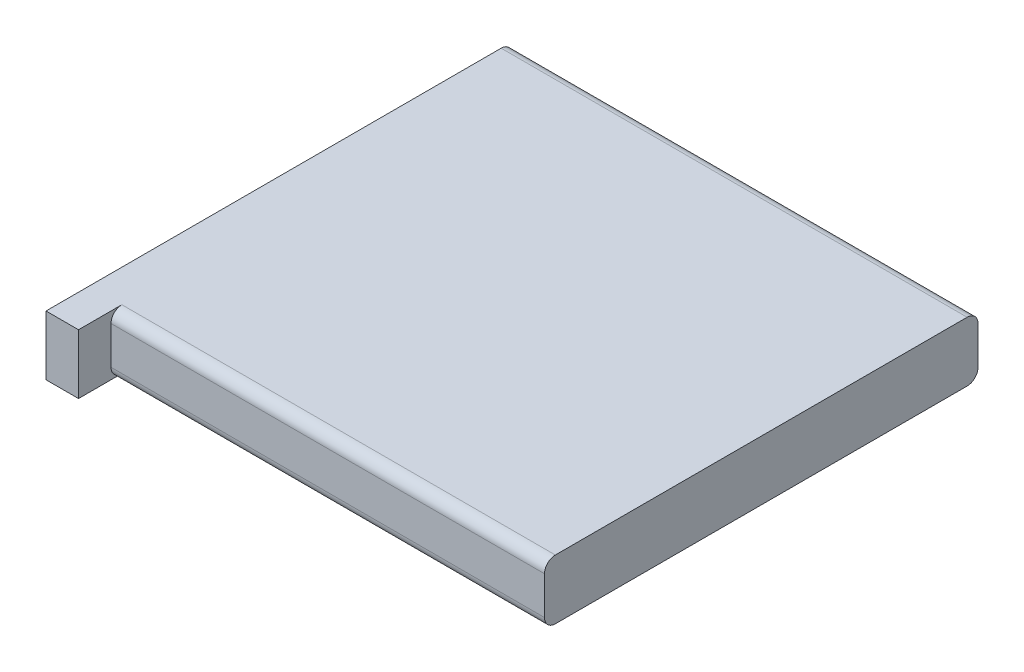
ISO-10303-21;
HEADER;
FILE_DESCRIPTION(('STEP AP214'),'2;1');
FILE_NAME('part.step','',(''),(''),'','','');
FILE_SCHEMA(('AUTOMOTIVE_DESIGN { 1 0 10303 214 1 1 1 1 }'));
ENDSEC;
DATA;
#1=APPLICATION_CONTEXT('core data for automotive mechanical design processes');
#2=APPLICATION_PROTOCOL_DEFINITION('international standard','automotive_design',2000,#1);
#3=PRODUCT_CONTEXT('',#1,'mechanical');
#4=PRODUCT('Part','Part','',(#3));
#5=PRODUCT_RELATED_PRODUCT_CATEGORY('part','',(#4));
#6=PRODUCT_DEFINITION_FORMATION('','',#4);
#7=PRODUCT_DEFINITION_CONTEXT('part definition',#1,'design');
#8=PRODUCT_DEFINITION('design','',#6,#7);
#9=PRODUCT_DEFINITION_SHAPE('','',#8);
#10=(LENGTH_UNIT() NAMED_UNIT(*) SI_UNIT(.MILLI.,.METRE.));
#11=(NAMED_UNIT(*) PLANE_ANGLE_UNIT() SI_UNIT($,.RADIAN.));
#12=(NAMED_UNIT(*) SI_UNIT($,.STERADIAN.) SOLID_ANGLE_UNIT());
#13=UNCERTAINTY_MEASURE_WITH_UNIT(LENGTH_MEASURE(1.E-05),#10,'distance_accuracy_value','');
#14=(GEOMETRIC_REPRESENTATION_CONTEXT(3) GLOBAL_UNCERTAINTY_ASSIGNED_CONTEXT((#13)) GLOBAL_UNIT_ASSIGNED_CONTEXT((#10,
#11,#12)) REPRESENTATION_CONTEXT('',''));
#15=CARTESIAN_POINT('',(0.,0.,0.));
#16=DIRECTION('',(0.,0.,1.));
#17=DIRECTION('',(1.,0.,0.));
#18=AXIS2_PLACEMENT_3D('',#15,#16,#17);
#19=CARTESIAN_POINT('',(-21.5,5.5,20.));
#20=DIRECTION('',(1.,0.,0.));
#21=DIRECTION('',(0.,0.,-1.));
#22=AXIS2_PLACEMENT_3D('',#19,#20,#21);
#23=PLANE('',#22);
#24=DIRECTION('',(0.,-1.,0.));
#25=VECTOR('',#24,1.);
#26=CARTESIAN_POINT('',(-21.5,5.5,23.));
#27=LINE('',#26,#25);
#28=CARTESIAN_POINT('',(-21.5,5.5,23.));
#29=VERTEX_POINT('',#28);
#30=CARTESIAN_POINT('',(-21.5,0.,23.));
#31=VERTEX_POINT('',#30);
#32=EDGE_CURVE('E116',#29,#31,#27,.T.);
#33=ORIENTED_EDGE('',*,*,#32,.F.);
#34=DIRECTION('',(0.,0.,1.));
#35=VECTOR('',#34,1.);
#36=CARTESIAN_POINT('',(-21.5,5.5,20.));
#37=LINE('',#36,#35);
#38=CARTESIAN_POINT('',(-21.5,5.5,-19.));
#39=VERTEX_POINT('',#38);
#40=EDGE_CURVE('E146',#39,#29,#37,.T.);
#41=ORIENTED_EDGE('',*,*,#40,.F.);
#42=CARTESIAN_POINT('',(-21.5,4.5,-19.));
#43=DIRECTION('',(1.,0.,0.));
#44=DIRECTION('',(0.,0.,-1.));
#45=AXIS2_PLACEMENT_3D('',#42,#43,#44);
#46=CIRCLE('',#45,1.);
#47=CARTESIAN_POINT('',(-21.5,4.5,-20.));
#48=VERTEX_POINT('',#47);
#49=EDGE_CURVE('E166',#39,#48,#46,.F.);
#50=ORIENTED_EDGE('',*,*,#49,.T.);
#51=DIRECTION('',(0.,-1.,0.));
#52=VECTOR('',#51,1.);
#53=CARTESIAN_POINT('',(-21.5,5.5,-20.));
#54=LINE('',#53,#52);
#55=CARTESIAN_POINT('',(-21.5,1.,-20.));
#56=VERTEX_POINT('',#55);
#57=EDGE_CURVE('E150',#48,#56,#54,.T.);
#58=ORIENTED_EDGE('',*,*,#57,.T.);
#59=CARTESIAN_POINT('',(-21.5,1.,-19.));
#60=DIRECTION('',(1.,0.,0.));
#61=DIRECTION('',(0.,0.,-1.));
#62=AXIS2_PLACEMENT_3D('',#59,#60,#61);
#63=CIRCLE('',#62,1.);
#64=CARTESIAN_POINT('',(-21.5,0.,-19.));
#65=VERTEX_POINT('',#64);
#66=EDGE_CURVE('E118',#56,#65,#63,.F.);
#67=ORIENTED_EDGE('',*,*,#66,.T.);
#68=DIRECTION('',(0.,0.,1.));
#69=VECTOR('',#68,1.);
#70=CARTESIAN_POINT('',(-21.5,0.,20.));
#71=LINE('',#70,#69);
#72=EDGE_CURVE('E112',#65,#31,#71,.T.);
#73=ORIENTED_EDGE('',*,*,#72,.T.);
#74=EDGE_LOOP('',(#33,#41,#50,#58,#67,#73));
#75=FACE_BOUND('',#74,.T.);
#76=ADVANCED_FACE('F33',(#75),#23,.F.);
#77=CARTESIAN_POINT('',(21.5,5.5,20.));
#78=DIRECTION('',(0.,0.,-1.));
#79=DIRECTION('',(-1.,0.,0.));
#80=AXIS2_PLACEMENT_3D('',#77,#78,#79);
#81=PLANE('',#80);
#82=DIRECTION('',(1.,0.,0.));
#83=VECTOR('',#82,1.);
#84=CARTESIAN_POINT('',(-21.5,4.5,20.));
#85=LINE('',#84,#83);
#86=CARTESIAN_POINT('',(21.5,4.5,20.));
#87=VERTEX_POINT('',#86);
#88=CARTESIAN_POINT('',(-18.5,4.5,20.));
#89=VERTEX_POINT('',#88);
#90=EDGE_CURVE('E186',#87,#89,#85,.F.);
#91=ORIENTED_EDGE('',*,*,#90,.T.);
#92=DIRECTION('',(0.,-1.,0.));
#93=VECTOR('',#92,1.);
#94=CARTESIAN_POINT('',(-18.5,5.49999999999997,20.));
#95=LINE('',#94,#93);
#96=CARTESIAN_POINT('',(-18.5,1.,20.));
#97=VERTEX_POINT('',#96);
#98=EDGE_CURVE('E48',#89,#97,#95,.T.);
#99=ORIENTED_EDGE('',*,*,#98,.T.);
#100=DIRECTION('',(1.,0.,0.));
#101=VECTOR('',#100,1.);
#102=CARTESIAN_POINT('',(21.5,1.,20.));
#103=LINE('',#102,#101);
#104=CARTESIAN_POINT('',(21.5,1.,20.));
#105=VERTEX_POINT('',#104);
#106=EDGE_CURVE('E41',#97,#105,#103,.T.);
#107=ORIENTED_EDGE('',*,*,#106,.T.);
#108=DIRECTION('',(0.,-1.,0.));
#109=VECTOR('',#108,1.);
#110=CARTESIAN_POINT('',(21.5,5.5,20.));
#111=LINE('',#110,#109);
#112=EDGE_CURVE('E158',#87,#105,#111,.T.);
#113=ORIENTED_EDGE('',*,*,#112,.F.);
#114=EDGE_LOOP('',(#91,#99,#107,#113));
#115=FACE_BOUND('',#114,.T.);
#116=ADVANCED_FACE('F189',(#115),#81,.F.);
#117=CARTESIAN_POINT('',(21.5,5.5,20.));
#118=DIRECTION('',(-1.,0.,0.));
#119=DIRECTION('',(0.,0.,1.));
#120=AXIS2_PLACEMENT_3D('',#117,#118,#119);
#121=PLANE('',#120);
#122=DIRECTION('',(0.,0.,-1.));
#123=VECTOR('',#122,1.);
#124=CARTESIAN_POINT('',(21.5,0.,20.));
#125=LINE('',#124,#123);
#126=CARTESIAN_POINT('',(21.5,0.,19.));
#127=VERTEX_POINT('',#126);
#128=CARTESIAN_POINT('',(21.5,0.,-19.));
#129=VERTEX_POINT('',#128);
#130=EDGE_CURVE('E121',#127,#129,#125,.T.);
#131=ORIENTED_EDGE('',*,*,#130,.T.);
#132=CARTESIAN_POINT('',(21.5,1.,-19.));
#133=DIRECTION('',(-1.,0.,0.));
#134=DIRECTION('',(0.,0.,1.));
#135=AXIS2_PLACEMENT_3D('',#132,#133,#134);
#136=CIRCLE('',#135,1.);
#137=CARTESIAN_POINT('',(21.5,1.,-20.));
#138=VERTEX_POINT('',#137);
#139=EDGE_CURVE('E179',#129,#138,#136,.F.);
#140=ORIENTED_EDGE('',*,*,#139,.T.);
#141=DIRECTION('',(0.,-1.,0.));
#142=VECTOR('',#141,1.);
#143=CARTESIAN_POINT('',(21.5,5.5,-20.));
#144=LINE('',#143,#142);
#145=CARTESIAN_POINT('',(21.5,4.5,-20.));
#146=VERTEX_POINT('',#145);
#147=EDGE_CURVE('E155',#146,#138,#144,.T.);
#148=ORIENTED_EDGE('',*,*,#147,.F.);
#149=CARTESIAN_POINT('',(21.5,4.5,-19.));
#150=DIRECTION('',(-1.,0.,0.));
#151=DIRECTION('',(0.,0.,1.));
#152=AXIS2_PLACEMENT_3D('',#149,#150,#151);
#153=CIRCLE('',#152,1.);
#154=CARTESIAN_POINT('',(21.5,5.5,-19.));
#155=VERTEX_POINT('',#154);
#156=EDGE_CURVE('E177',#146,#155,#153,.F.);
#157=ORIENTED_EDGE('',*,*,#156,.T.);
#158=DIRECTION('',(0.,0.,-1.));
#159=VECTOR('',#158,1.);
#160=CARTESIAN_POINT('',(21.5,5.5,20.));
#161=LINE('',#160,#159);
#162=CARTESIAN_POINT('',(21.5,5.5,19.));
#163=VERTEX_POINT('',#162);
#164=EDGE_CURVE('E148',#163,#155,#161,.T.);
#165=ORIENTED_EDGE('',*,*,#164,.F.);
#166=CARTESIAN_POINT('',(21.5,4.5,19.));
#167=DIRECTION('',(-1.,0.,0.));
#168=DIRECTION('',(0.,0.,1.));
#169=AXIS2_PLACEMENT_3D('',#166,#167,#168);
#170=CIRCLE('',#169,1.);
#171=EDGE_CURVE('E173',#163,#87,#170,.F.);
#172=ORIENTED_EDGE('',*,*,#171,.T.);
#173=ORIENTED_EDGE('',*,*,#112,.T.);
#174=CARTESIAN_POINT('',(21.5,1.,19.));
#175=DIRECTION('',(-1.,0.,0.));
#176=DIRECTION('',(0.,0.,1.));
#177=AXIS2_PLACEMENT_3D('',#174,#175,#176);
#178=CIRCLE('',#177,1.);
#179=EDGE_CURVE('E175',#105,#127,#178,.F.);
#180=ORIENTED_EDGE('',*,*,#179,.T.);
#181=EDGE_LOOP('',(#131,#140,#148,#157,#165,#172,#173,#180));
#182=FACE_BOUND('',#181,.T.);
#183=ADVANCED_FACE('F194',(#182),#121,.F.);
#184=CARTESIAN_POINT('',(21.5,5.5,-20.));
#185=DIRECTION('',(0.,0.,1.));
#186=DIRECTION('',(1.,0.,0.));
#187=AXIS2_PLACEMENT_3D('',#184,#185,#186);
#188=PLANE('',#187);
#189=ORIENTED_EDGE('',*,*,#147,.T.);
#190=DIRECTION('',(-1.,0.,0.));
#191=VECTOR('',#190,1.);
#192=CARTESIAN_POINT('',(21.5,1.,-20.));
#193=LINE('',#192,#191);
#194=EDGE_CURVE('E163',#138,#56,#193,.T.);
#195=ORIENTED_EDGE('',*,*,#194,.T.);
#196=ORIENTED_EDGE('',*,*,#57,.F.);
#197=DIRECTION('',(-1.,0.,0.));
#198=VECTOR('',#197,1.);
#199=CARTESIAN_POINT('',(21.5,4.5,-20.));
#200=LINE('',#199,#198);
#201=EDGE_CURVE('E161',#48,#146,#200,.F.);
#202=ORIENTED_EDGE('',*,*,#201,.T.);
#203=EDGE_LOOP('',(#189,#195,#196,#202));
#204=FACE_BOUND('',#203,.T.);
#205=ADVANCED_FACE('F208',(#204),#188,.F.);
#206=CARTESIAN_POINT('',(0.,5.5,0.));
#207=DIRECTION('',(0.,1.,0.));
#208=DIRECTION('',(0.,0.,1.));
#209=AXIS2_PLACEMENT_3D('',#206,#207,#208);
#210=PLANE('',#209);
#211=DIRECTION('',(0.,0.,1.));
#212=VECTOR('',#211,1.);
#213=CARTESIAN_POINT('',(-18.5,5.5,17.));
#214=LINE('',#213,#212);
#215=CARTESIAN_POINT('',(-18.5,5.5,19.));
#216=VERTEX_POINT('',#215);
#217=CARTESIAN_POINT('',(-18.5,5.5,23.));
#218=VERTEX_POINT('',#217);
#219=EDGE_CURVE('E141',#216,#218,#214,.T.);
#220=ORIENTED_EDGE('',*,*,#219,.F.);
#221=DIRECTION('',(1.,0.,0.));
#222=VECTOR('',#221,1.);
#223=CARTESIAN_POINT('',(21.5,5.5,19.));
#224=LINE('',#223,#222);
#225=EDGE_CURVE('E181',#216,#163,#224,.T.);
#226=ORIENTED_EDGE('',*,*,#225,.T.);
#227=ORIENTED_EDGE('',*,*,#164,.T.);
#228=DIRECTION('',(-1.,0.,0.));
#229=VECTOR('',#228,1.);
#230=CARTESIAN_POINT('',(-21.5,5.5,-19.));
#231=LINE('',#230,#229);
#232=EDGE_CURVE('E183',#155,#39,#231,.T.);
#233=ORIENTED_EDGE('',*,*,#232,.T.);
#234=ORIENTED_EDGE('',*,*,#40,.T.);
#235=DIRECTION('',(-1.,0.,0.));
#236=VECTOR('',#235,1.);
#237=CARTESIAN_POINT('',(-21.5,5.5,23.));
#238=LINE('',#237,#236);
#239=EDGE_CURVE('E136',#218,#29,#238,.T.);
#240=ORIENTED_EDGE('',*,*,#239,.F.);
#241=EDGE_LOOP('',(#220,#226,#227,#233,#234,#240));
#242=FACE_BOUND('',#241,.T.);
#243=ADVANCED_FACE('F202',(#242),#210,.T.);
#244=CARTESIAN_POINT('',(0.,0.,0.));
#245=DIRECTION('',(0.,1.,0.));
#246=DIRECTION('',(0.,0.,1.));
#247=AXIS2_PLACEMENT_3D('',#244,#245,#246);
#248=PLANE('',#247);
#249=DIRECTION('',(1.,0.,0.));
#250=VECTOR('',#249,1.);
#251=CARTESIAN_POINT('',(0.,0.,19.));
#252=LINE('',#251,#250);
#253=CARTESIAN_POINT('',(-18.5,0.,19.));
#254=VERTEX_POINT('',#253);
#255=EDGE_CURVE('E169',#127,#254,#252,.F.);
#256=ORIENTED_EDGE('',*,*,#255,.T.);
#257=DIRECTION('',(0.,0.,1.));
#258=VECTOR('',#257,1.);
#259=CARTESIAN_POINT('',(-18.5,0.,17.));
#260=LINE('',#259,#258);
#261=CARTESIAN_POINT('',(-18.5,0.,23.));
#262=VERTEX_POINT('',#261);
#263=EDGE_CURVE('E127',#254,#262,#260,.T.);
#264=ORIENTED_EDGE('',*,*,#263,.T.);
#265=DIRECTION('',(1.,0.,0.));
#266=VECTOR('',#265,1.);
#267=CARTESIAN_POINT('',(-21.5,0.,23.));
#268=LINE('',#267,#266);
#269=EDGE_CURVE('E124',#31,#262,#268,.T.);
#270=ORIENTED_EDGE('',*,*,#269,.F.);
#271=ORIENTED_EDGE('',*,*,#72,.F.);
#272=DIRECTION('',(-1.,0.,0.));
#273=VECTOR('',#272,1.);
#274=CARTESIAN_POINT('',(0.,0.,-19.));
#275=LINE('',#274,#273);
#276=EDGE_CURVE('E171',#65,#129,#275,.F.);
#277=ORIENTED_EDGE('',*,*,#276,.T.);
#278=ORIENTED_EDGE('',*,*,#130,.F.);
#279=EDGE_LOOP('',(#256,#264,#270,#271,#277,#278));
#280=FACE_BOUND('',#279,.T.);
#281=ADVANCED_FACE('F125',(#280),#248,.F.);
#282=CARTESIAN_POINT('',(21.5,1.,-19.));
#283=DIRECTION('',(-1.,0.,0.));
#284=DIRECTION('',(0.,0.,1.));
#285=AXIS2_PLACEMENT_3D('',#282,#283,#284);
#286=CYLINDRICAL_SURFACE('',#285,1.);
#287=ORIENTED_EDGE('',*,*,#139,.F.);
#288=ORIENTED_EDGE('',*,*,#276,.F.);
#289=ORIENTED_EDGE('',*,*,#66,.F.);
#290=ORIENTED_EDGE('',*,*,#194,.F.);
#291=EDGE_LOOP('',(#287,#288,#289,#290));
#292=FACE_BOUND('',#291,.T.);
#293=ADVANCED_FACE('F215',(#292),#286,.T.);
#294=CARTESIAN_POINT('',(0.,4.5,-19.));
#295=DIRECTION('',(1.,0.,0.));
#296=DIRECTION('',(0.,0.,-1.));
#297=AXIS2_PLACEMENT_3D('',#294,#295,#296);
#298=CYLINDRICAL_SURFACE('',#297,1.);
#299=ORIENTED_EDGE('',*,*,#156,.F.);
#300=ORIENTED_EDGE('',*,*,#201,.F.);
#301=ORIENTED_EDGE('',*,*,#49,.F.);
#302=ORIENTED_EDGE('',*,*,#232,.F.);
#303=EDGE_LOOP('',(#299,#300,#301,#302));
#304=FACE_BOUND('',#303,.T.);
#305=ADVANCED_FACE('F212',(#304),#298,.T.);
#306=CARTESIAN_POINT('',(21.5,1.,19.));
#307=DIRECTION('',(1.,0.,0.));
#308=DIRECTION('',(0.,0.,-1.));
#309=AXIS2_PLACEMENT_3D('',#306,#307,#308);
#310=CYLINDRICAL_SURFACE('',#309,1.);
#311=CARTESIAN_POINT('',(-18.5,1.,19.));
#312=DIRECTION('',(1.,0.,0.));
#313=DIRECTION('',(0.,1.,0.));
#314=AXIS2_PLACEMENT_3D('',#311,#312,#313);
#315=CIRCLE('',#314,1.);
#316=EDGE_CURVE('E55',#254,#97,#315,.F.);
#317=ORIENTED_EDGE('',*,*,#316,.F.);
#318=ORIENTED_EDGE('',*,*,#255,.F.);
#319=ORIENTED_EDGE('',*,*,#179,.F.);
#320=ORIENTED_EDGE('',*,*,#106,.F.);
#321=EDGE_LOOP('',(#317,#318,#319,#320));
#322=FACE_BOUND('',#321,.T.);
#323=ADVANCED_FACE('F191',(#322),#310,.T.);
#324=CARTESIAN_POINT('',(0.,4.5,19.));
#325=DIRECTION('',(-1.,0.,0.));
#326=DIRECTION('',(0.,0.,1.));
#327=AXIS2_PLACEMENT_3D('',#324,#325,#326);
#328=CYLINDRICAL_SURFACE('',#327,1.);
#329=CARTESIAN_POINT('',(-18.5,4.5,19.));
#330=DIRECTION('',(1.,0.,0.));
#331=DIRECTION('',(0.,1.,0.));
#332=AXIS2_PLACEMENT_3D('',#329,#330,#331);
#333=CIRCLE('',#332,1.);
#334=EDGE_CURVE('E11',#89,#216,#333,.F.);
#335=ORIENTED_EDGE('',*,*,#334,.F.);
#336=ORIENTED_EDGE('',*,*,#90,.F.);
#337=ORIENTED_EDGE('',*,*,#171,.F.);
#338=ORIENTED_EDGE('',*,*,#225,.F.);
#339=EDGE_LOOP('',(#335,#336,#337,#338));
#340=FACE_BOUND('',#339,.T.);
#341=ADVANCED_FACE('F35',(#340),#328,.T.);
#342=CARTESIAN_POINT('',(-18.5,5.5,17.));
#343=DIRECTION('',(1.,0.,0.));
#344=DIRECTION('',(0.,1.,0.));
#345=AXIS2_PLACEMENT_3D('',#342,#343,#344);
#346=PLANE('',#345);
#347=ORIENTED_EDGE('',*,*,#263,.F.);
#348=ORIENTED_EDGE('',*,*,#316,.T.);
#349=ORIENTED_EDGE('',*,*,#98,.F.);
#350=ORIENTED_EDGE('',*,*,#334,.T.);
#351=ORIENTED_EDGE('',*,*,#219,.T.);
#352=DIRECTION('',(0.,1.,0.));
#353=VECTOR('',#352,1.);
#354=CARTESIAN_POINT('',(-18.5,5.5,23.));
#355=LINE('',#354,#353);
#356=EDGE_CURVE('E131',#262,#218,#355,.T.);
#357=ORIENTED_EDGE('',*,*,#356,.F.);
#358=EDGE_LOOP('',(#347,#348,#349,#350,#351,#357));
#359=FACE_BOUND('',#358,.T.);
#360=ADVANCED_FACE('F199',(#359),#346,.T.);
#361=CARTESIAN_POINT('',(0.,0.,23.));
#362=DIRECTION('',(0.,0.,1.));
#363=DIRECTION('',(1.,0.,0.));
#364=AXIS2_PLACEMENT_3D('',#361,#362,#363);
#365=PLANE('',#364);
#366=ORIENTED_EDGE('',*,*,#32,.T.);
#367=ORIENTED_EDGE('',*,*,#269,.T.);
#368=ORIENTED_EDGE('',*,*,#356,.T.);
#369=ORIENTED_EDGE('',*,*,#239,.T.);
#370=EDGE_LOOP('',(#366,#367,#368,#369));
#371=FACE_BOUND('',#370,.T.);
#372=ADVANCED_FACE('F134',(#371),#365,.T.);
#373=CLOSED_SHELL('',(#76,#116,#183,#205,#243,#281,#293,#305,#323,#341,#360,#372));
#374=MANIFOLD_SOLID_BREP('B2',#373);
#375=ADVANCED_BREP_SHAPE_REPRESENTATION('',(#18,#374),#14);
#376=SHAPE_DEFINITION_REPRESENTATION(#9,#375);
ENDSEC;
END-ISO-10303-21;
